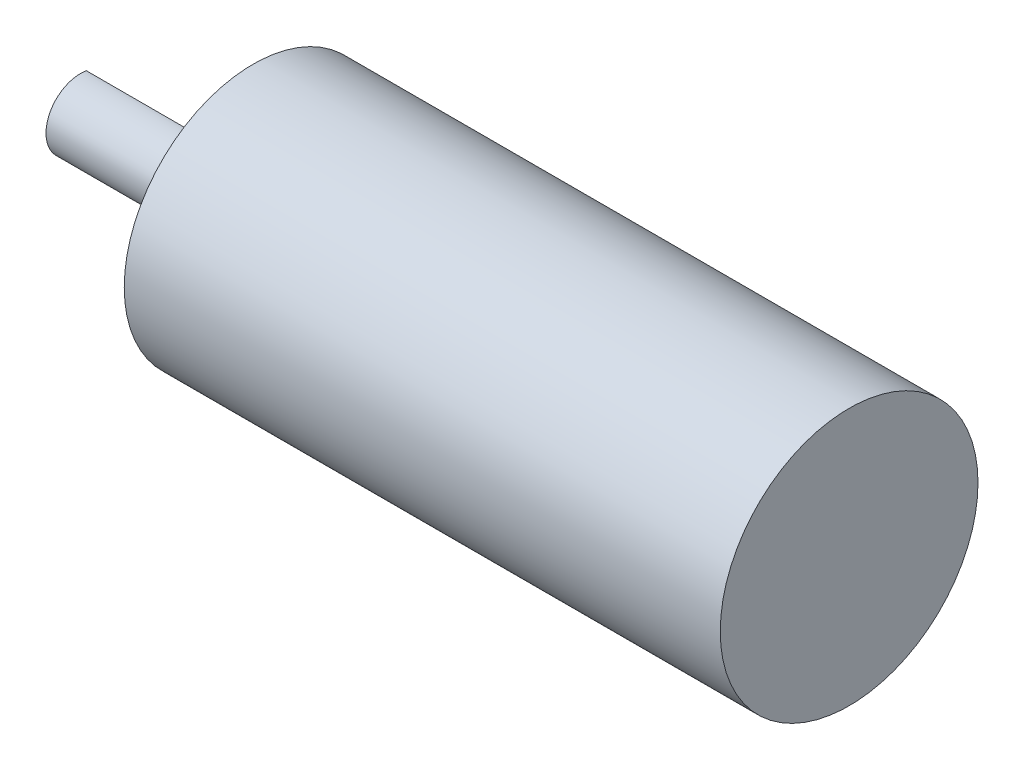
ISO-10303-21;
HEADER;
FILE_DESCRIPTION(('STEP AP214'),'2;1');
FILE_NAME('part.step','',(''),(''),'','','');
FILE_SCHEMA(('AUTOMOTIVE_DESIGN { 1 0 10303 214 1 1 1 1 }'));
ENDSEC;
DATA;
#1=APPLICATION_CONTEXT('core data for automotive mechanical design processes');
#2=APPLICATION_PROTOCOL_DEFINITION('international standard','automotive_design',2000,#1);
#3=PRODUCT_CONTEXT('',#1,'mechanical');
#4=PRODUCT('Part','Part','',(#3));
#5=PRODUCT_RELATED_PRODUCT_CATEGORY('part','',(#4));
#6=PRODUCT_DEFINITION_FORMATION('','',#4);
#7=PRODUCT_DEFINITION_CONTEXT('part definition',#1,'design');
#8=PRODUCT_DEFINITION('design','',#6,#7);
#9=PRODUCT_DEFINITION_SHAPE('','',#8);
#10=(LENGTH_UNIT() NAMED_UNIT(*) SI_UNIT(.MILLI.,.METRE.));
#11=(NAMED_UNIT(*) PLANE_ANGLE_UNIT() SI_UNIT($,.RADIAN.));
#12=(NAMED_UNIT(*) SI_UNIT($,.STERADIAN.) SOLID_ANGLE_UNIT());
#13=UNCERTAINTY_MEASURE_WITH_UNIT(LENGTH_MEASURE(1.E-05),#10,'distance_accuracy_value','');
#14=(GEOMETRIC_REPRESENTATION_CONTEXT(3) GLOBAL_UNCERTAINTY_ASSIGNED_CONTEXT((#13)) GLOBAL_UNIT_ASSIGNED_CONTEXT((#10,
#11,#12)) REPRESENTATION_CONTEXT('',''));
#15=CARTESIAN_POINT('',(0.,0.,0.));
#16=DIRECTION('',(0.,0.,1.));
#17=DIRECTION('',(1.,0.,0.));
#18=AXIS2_PLACEMENT_3D('',#15,#16,#17);
#19=CARTESIAN_POINT('',(-51.8,0.,0.));
#20=DIRECTION('',(1.,0.,0.));
#21=DIRECTION('',(0.,0.,-1.));
#22=AXIS2_PLACEMENT_3D('',#19,#20,#21);
#23=PLANE('',#22);
#24=CARTESIAN_POINT('',(-51.8,0.,0.));
#25=DIRECTION('',(1.,0.,0.));
#26=DIRECTION('',(0.,0.,-1.));
#27=AXIS2_PLACEMENT_3D('',#24,#25,#26);
#28=CIRCLE('',#27,11.2);
#29=CARTESIAN_POINT('',(-51.8,0.,-11.2));
#30=VERTEX_POINT('',#29);
#31=EDGE_CURVE('E11',#30,#30,#28,.T.);
#32=ORIENTED_EDGE('',*,*,#31,.F.);
#33=EDGE_LOOP('',(#32));
#34=FACE_BOUND('',#33,.T.);
#35=CARTESIAN_POINT('',(-51.8,0.,0.));
#36=DIRECTION('',(-1.,0.,0.));
#37=DIRECTION('',(0.,0.,1.));
#38=AXIS2_PLACEMENT_3D('',#35,#36,#37);
#39=CIRCLE('',#38,3.);
#40=CARTESIAN_POINT('',(-51.8,-2.95803989154981,-0.5));
#41=VERTEX_POINT('',#40);
#42=CARTESIAN_POINT('',(-51.8,2.95803989154981,-0.5));
#43=VERTEX_POINT('',#42);
#44=EDGE_CURVE('E69',#41,#43,#39,.T.);
#45=ORIENTED_EDGE('',*,*,#44,.F.);
#46=DIRECTION('',(0.,-1.,0.));
#47=VECTOR('',#46,1.);
#48=CARTESIAN_POINT('',(-51.8,2.95803989154981,-0.5));
#49=LINE('',#48,#47);
#50=EDGE_CURVE('E56',#43,#41,#49,.T.);
#51=ORIENTED_EDGE('',*,*,#50,.F.);
#52=EDGE_LOOP('',(#45,#51));
#53=FACE_BOUND('',#52,.T.);
#54=ADVANCED_FACE('F41',(#34,#53),#23,.F.);
#55=CARTESIAN_POINT('',(-51.8,0.,0.));
#56=DIRECTION('',(1.,0.,0.));
#57=DIRECTION('',(0.,0.,-1.));
#58=AXIS2_PLACEMENT_3D('',#55,#56,#57);
#59=CYLINDRICAL_SURFACE('',#58,11.2);
#60=ORIENTED_EDGE('',*,*,#31,.T.);
#61=EDGE_LOOP('',(#60));
#62=FACE_BOUND('',#61,.T.);
#63=CARTESIAN_POINT('',(0.,0.,0.));
#64=DIRECTION('',(1.,0.,0.));
#65=DIRECTION('',(0.,0.,-1.));
#66=AXIS2_PLACEMENT_3D('',#63,#64,#65);
#67=CIRCLE('',#66,11.2);
#68=CARTESIAN_POINT('',(0.,0.,-11.2));
#69=VERTEX_POINT('',#68);
#70=EDGE_CURVE('E45',#69,#69,#67,.T.);
#71=ORIENTED_EDGE('',*,*,#70,.F.);
#72=EDGE_LOOP('',(#71));
#73=FACE_BOUND('',#72,.T.);
#74=ADVANCED_FACE('F43',(#62,#73),#59,.T.);
#75=CARTESIAN_POINT('',(0.,0.,0.));
#76=DIRECTION('',(1.,0.,0.));
#77=DIRECTION('',(0.,0.,-1.));
#78=AXIS2_PLACEMENT_3D('',#75,#76,#77);
#79=PLANE('',#78);
#80=ORIENTED_EDGE('',*,*,#70,.T.);
#81=EDGE_LOOP('',(#80));
#82=FACE_BOUND('',#81,.T.);
#83=ADVANCED_FACE('F105',(#82),#79,.T.);
#84=CARTESIAN_POINT('',(-66.8,0.,0.));
#85=DIRECTION('',(1.,0.,0.));
#86=DIRECTION('',(0.,0.,-1.));
#87=AXIS2_PLACEMENT_3D('',#84,#85,#86);
#88=CYLINDRICAL_SURFACE('',#87,3.);
#89=ORIENTED_EDGE('',*,*,#44,.T.);
#90=DIRECTION('',(1.,0.,0.));
#91=VECTOR('',#90,1.);
#92=CARTESIAN_POINT('',(-66.8,2.95803989154981,-0.5));
#93=LINE('',#92,#91);
#94=CARTESIAN_POINT('',(-66.8,2.95803989154981,-0.5));
#95=VERTEX_POINT('',#94);
#96=EDGE_CURVE('E79',#95,#43,#93,.T.);
#97=ORIENTED_EDGE('',*,*,#96,.F.);
#98=CARTESIAN_POINT('',(-66.8,0.,0.));
#99=DIRECTION('',(-1.,0.,0.));
#100=DIRECTION('',(0.,0.,1.));
#101=AXIS2_PLACEMENT_3D('',#98,#99,#100);
#102=CIRCLE('',#101,3.);
#103=CARTESIAN_POINT('',(-66.8,-2.95803989154981,-0.5));
#104=VERTEX_POINT('',#103);
#105=EDGE_CURVE('E81',#104,#95,#102,.T.);
#106=ORIENTED_EDGE('',*,*,#105,.F.);
#107=DIRECTION('',(1.,0.,0.));
#108=VECTOR('',#107,1.);
#109=CARTESIAN_POINT('',(-66.8,-2.95803989154981,-0.5));
#110=LINE('',#109,#108);
#111=EDGE_CURVE('E77',#104,#41,#110,.T.);
#112=ORIENTED_EDGE('',*,*,#111,.T.);
#113=EDGE_LOOP('',(#89,#97,#106,#112));
#114=FACE_BOUND('',#113,.T.);
#115=ADVANCED_FACE('F83',(#114),#88,.T.);
#116=CARTESIAN_POINT('',(-66.8,2.95803989154981,-0.5));
#117=DIRECTION('',(0.,0.,1.));
#118=DIRECTION('',(1.,0.,0.));
#119=AXIS2_PLACEMENT_3D('',#116,#117,#118);
#120=PLANE('',#119);
#121=ORIENTED_EDGE('',*,*,#50,.T.);
#122=ORIENTED_EDGE('',*,*,#111,.F.);
#123=DIRECTION('',(0.,-1.,0.));
#124=VECTOR('',#123,1.);
#125=CARTESIAN_POINT('',(-66.8,2.95803989154981,-0.5));
#126=LINE('',#125,#124);
#127=EDGE_CURVE('E64',#95,#104,#126,.T.);
#128=ORIENTED_EDGE('',*,*,#127,.F.);
#129=ORIENTED_EDGE('',*,*,#96,.T.);
#130=EDGE_LOOP('',(#121,#122,#128,#129));
#131=FACE_BOUND('',#130,.T.);
#132=ADVANCED_FACE('F76',(#131),#120,.F.);
#133=CARTESIAN_POINT('',(-66.8,0.,0.));
#134=DIRECTION('',(-1.,0.,0.));
#135=DIRECTION('',(0.,0.,1.));
#136=AXIS2_PLACEMENT_3D('',#133,#134,#135);
#137=PLANE('',#136);
#138=ORIENTED_EDGE('',*,*,#105,.T.);
#139=ORIENTED_EDGE('',*,*,#127,.T.);
#140=EDGE_LOOP('',(#138,#139));
#141=FACE_BOUND('',#140,.T.);
#142=ADVANCED_FACE('F92',(#141),#137,.T.);
#143=CLOSED_SHELL('',(#54,#74,#83,#115,#132,#142));
#144=MANIFOLD_SOLID_BREP('B2',#143);
#145=ADVANCED_BREP_SHAPE_REPRESENTATION('',(#18,#144),#14);
#146=SHAPE_DEFINITION_REPRESENTATION(#9,#145);
ENDSEC;
END-ISO-10303-21;
